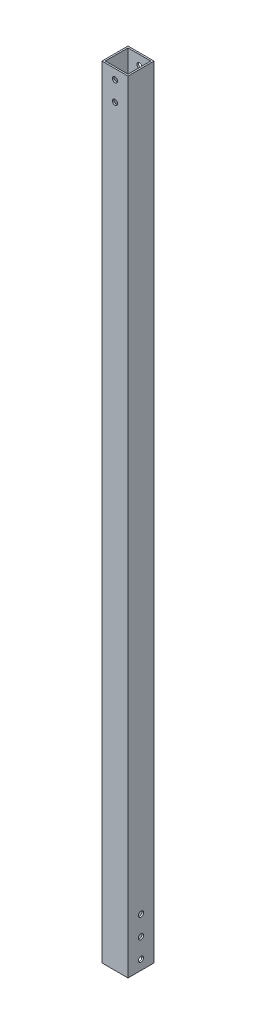
ISO-10303-21;
HEADER;
FILE_DESCRIPTION(('STEP AP214'),'2;1');
FILE_NAME('part.step','',(''),(''),'','','');
FILE_SCHEMA(('AUTOMOTIVE_DESIGN { 1 0 10303 214 1 1 1 1 }'));
ENDSEC;
DATA;
#1=APPLICATION_CONTEXT('core data for automotive mechanical design processes');
#2=APPLICATION_PROTOCOL_DEFINITION('international standard','automotive_design',2000,#1);
#3=PRODUCT_CONTEXT('',#1,'mechanical');
#4=PRODUCT('Part','Part','',(#3));
#5=PRODUCT_RELATED_PRODUCT_CATEGORY('part','',(#4));
#6=PRODUCT_DEFINITION_FORMATION('','',#4);
#7=PRODUCT_DEFINITION_CONTEXT('part definition',#1,'design');
#8=PRODUCT_DEFINITION('design','',#6,#7);
#9=PRODUCT_DEFINITION_SHAPE('','',#8);
#10=(LENGTH_UNIT() NAMED_UNIT(*) SI_UNIT(.MILLI.,.METRE.));
#11=(NAMED_UNIT(*) PLANE_ANGLE_UNIT() SI_UNIT($,.RADIAN.));
#12=(NAMED_UNIT(*) SI_UNIT($,.STERADIAN.) SOLID_ANGLE_UNIT());
#13=UNCERTAINTY_MEASURE_WITH_UNIT(LENGTH_MEASURE(1.E-05),#10,'distance_accuracy_value','');
#14=(GEOMETRIC_REPRESENTATION_CONTEXT(3) GLOBAL_UNCERTAINTY_ASSIGNED_CONTEXT((#13)) GLOBAL_UNIT_ASSIGNED_CONTEXT((#10,
#11,#12)) REPRESENTATION_CONTEXT('',''));
#15=CARTESIAN_POINT('',(0.,0.,0.));
#16=DIRECTION('',(0.,0.,1.));
#17=DIRECTION('',(1.,0.,0.));
#18=AXIS2_PLACEMENT_3D('',#15,#16,#17);
#19=CARTESIAN_POINT('',(0.,752.475,-12.7));
#20=DIRECTION('',(0.,0.,1.));
#21=DIRECTION('',(1.,0.,0.));
#22=AXIS2_PLACEMENT_3D('',#19,#20,#21);
#23=CYLINDRICAL_SURFACE('',#22,2.5527);
#24=CARTESIAN_POINT('',(0.,752.475,-11.1125));
#25=DIRECTION('',(0.,0.,1.));
#26=DIRECTION('',(1.,0.,0.));
#27=AXIS2_PLACEMENT_3D('',#24,#25,#26);
#28=CIRCLE('',#27,2.5527);
#29=CARTESIAN_POINT('',(2.5527,752.475,-11.1125));
#30=VERTEX_POINT('',#29);
#31=EDGE_CURVE('E263',#30,#30,#28,.T.);
#32=ORIENTED_EDGE('',*,*,#31,.T.);
#33=EDGE_LOOP('',(#32));
#34=FACE_BOUND('',#33,.T.);
#35=CARTESIAN_POINT('',(0.,752.475,-12.7));
#36=DIRECTION('',(0.,0.,1.));
#37=DIRECTION('',(1.,0.,0.));
#38=AXIS2_PLACEMENT_3D('',#35,#36,#37);
#39=CIRCLE('',#38,2.5527);
#40=CARTESIAN_POINT('',(2.5527,752.475,-12.7));
#41=VERTEX_POINT('',#40);
#42=EDGE_CURVE('E257',#41,#41,#39,.T.);
#43=ORIENTED_EDGE('',*,*,#42,.F.);
#44=EDGE_LOOP('',(#43));
#45=FACE_BOUND('',#44,.T.);
#46=ADVANCED_FACE('F17',(#34,#45),#23,.F.);
#47=CARTESIAN_POINT('',(0.,733.425,-12.7));
#48=DIRECTION('',(0.,0.,1.));
#49=DIRECTION('',(1.,0.,0.));
#50=AXIS2_PLACEMENT_3D('',#47,#48,#49);
#51=CYLINDRICAL_SURFACE('',#50,2.55270000000004);
#52=CARTESIAN_POINT('',(0.,733.425,-11.1125));
#53=DIRECTION('',(0.,0.,1.));
#54=DIRECTION('',(1.,0.,0.));
#55=AXIS2_PLACEMENT_3D('',#52,#53,#54);
#56=CIRCLE('',#55,2.55270000000004);
#57=CARTESIAN_POINT('',(2.55270000000004,733.425,-11.1125));
#58=VERTEX_POINT('',#57);
#59=EDGE_CURVE('E274',#58,#58,#56,.T.);
#60=ORIENTED_EDGE('',*,*,#59,.T.);
#61=EDGE_LOOP('',(#60));
#62=FACE_BOUND('',#61,.T.);
#63=CARTESIAN_POINT('',(0.,733.425,-12.7));
#64=DIRECTION('',(0.,0.,1.));
#65=DIRECTION('',(1.,0.,0.));
#66=AXIS2_PLACEMENT_3D('',#63,#64,#65);
#67=CIRCLE('',#66,2.55270000000004);
#68=CARTESIAN_POINT('',(2.55270000000004,733.425,-12.7));
#69=VERTEX_POINT('',#68);
#70=EDGE_CURVE('E196',#69,#69,#67,.T.);
#71=ORIENTED_EDGE('',*,*,#70,.F.);
#72=EDGE_LOOP('',(#71));
#73=FACE_BOUND('',#72,.T.);
#74=ADVANCED_FACE('F508',(#62,#73),#51,.F.);
#75=CARTESIAN_POINT('',(0.,752.475,-12.7));
#76=DIRECTION('',(0.,0.,1.));
#77=DIRECTION('',(1.,0.,0.));
#78=AXIS2_PLACEMENT_3D('',#75,#76,#77);
#79=CYLINDRICAL_SURFACE('',#78,2.5527);
#80=CARTESIAN_POINT('',(0.,752.475,11.1125));
#81=DIRECTION('',(0.,0.,-1.));
#82=DIRECTION('',(-1.,0.,0.));
#83=AXIS2_PLACEMENT_3D('',#80,#81,#82);
#84=CIRCLE('',#83,2.5527);
#85=CARTESIAN_POINT('',(-2.55270000000004,752.475,11.1125));
#86=VERTEX_POINT('',#85);
#87=EDGE_CURVE('E296',#86,#86,#84,.T.);
#88=ORIENTED_EDGE('',*,*,#87,.T.);
#89=EDGE_LOOP('',(#88));
#90=FACE_BOUND('',#89,.T.);
#91=CARTESIAN_POINT('',(0.,752.475,12.7));
#92=DIRECTION('',(0.,0.,1.));
#93=DIRECTION('',(1.,0.,0.));
#94=AXIS2_PLACEMENT_3D('',#91,#92,#93);
#95=CIRCLE('',#94,2.5527);
#96=CARTESIAN_POINT('',(2.5527,752.475,12.7));
#97=VERTEX_POINT('',#96);
#98=EDGE_CURVE('E249',#97,#97,#95,.T.);
#99=ORIENTED_EDGE('',*,*,#98,.T.);
#100=EDGE_LOOP('',(#99));
#101=FACE_BOUND('',#100,.T.);
#102=ADVANCED_FACE('F497',(#90,#101),#79,.F.);
#103=CARTESIAN_POINT('',(0.,733.425,-12.7));
#104=DIRECTION('',(0.,0.,1.));
#105=DIRECTION('',(1.,0.,0.));
#106=AXIS2_PLACEMENT_3D('',#103,#104,#105);
#107=CYLINDRICAL_SURFACE('',#106,2.55270000000004);
#108=CARTESIAN_POINT('',(0.,733.425,11.1125));
#109=DIRECTION('',(0.,0.,-1.));
#110=DIRECTION('',(-1.,0.,0.));
#111=AXIS2_PLACEMENT_3D('',#108,#109,#110);
#112=CIRCLE('',#111,2.55270000000004);
#113=CARTESIAN_POINT('',(-2.55270000000004,733.425,11.1125));
#114=VERTEX_POINT('',#113);
#115=EDGE_CURVE('E299',#114,#114,#112,.T.);
#116=ORIENTED_EDGE('',*,*,#115,.T.);
#117=EDGE_LOOP('',(#116));
#118=FACE_BOUND('',#117,.T.);
#119=CARTESIAN_POINT('',(0.,733.425,12.7));
#120=DIRECTION('',(0.,0.,1.));
#121=DIRECTION('',(1.,0.,0.));
#122=AXIS2_PLACEMENT_3D('',#119,#120,#121);
#123=CIRCLE('',#122,2.55270000000004);
#124=CARTESIAN_POINT('',(2.55270000000004,733.425,12.7));
#125=VERTEX_POINT('',#124);
#126=EDGE_CURVE('E245',#125,#125,#123,.T.);
#127=ORIENTED_EDGE('',*,*,#126,.T.);
#128=EDGE_LOOP('',(#127));
#129=FACE_BOUND('',#128,.T.);
#130=ADVANCED_FACE('F487',(#118,#129),#107,.F.);
#131=CARTESIAN_POINT('',(12.7,47.625,0.));
#132=DIRECTION('',(-1.,0.,0.));
#133=DIRECTION('',(0.,0.,1.));
#134=AXIS2_PLACEMENT_3D('',#131,#132,#133);
#135=CYLINDRICAL_SURFACE('',#134,2.5527);
#136=CARTESIAN_POINT('',(-11.1125,47.625,0.));
#137=DIRECTION('',(1.,0.,0.));
#138=DIRECTION('',(0.,0.,-1.));
#139=AXIS2_PLACEMENT_3D('',#136,#137,#138);
#140=CIRCLE('',#139,2.5527);
#141=CARTESIAN_POINT('',(-11.1125,47.625,-2.5527));
#142=VERTEX_POINT('',#141);
#143=EDGE_CURVE('E284',#142,#142,#140,.T.);
#144=ORIENTED_EDGE('',*,*,#143,.T.);
#145=EDGE_LOOP('',(#144));
#146=FACE_BOUND('',#145,.T.);
#147=CARTESIAN_POINT('',(-12.7,47.625,0.));
#148=DIRECTION('',(-1.,0.,0.));
#149=DIRECTION('',(0.,0.,1.));
#150=AXIS2_PLACEMENT_3D('',#147,#148,#149);
#151=CIRCLE('',#150,2.5527);
#152=CARTESIAN_POINT('',(-12.7,47.625,2.5527));
#153=VERTEX_POINT('',#152);
#154=EDGE_CURVE('E195',#153,#153,#151,.T.);
#155=ORIENTED_EDGE('',*,*,#154,.T.);
#156=EDGE_LOOP('',(#155));
#157=FACE_BOUND('',#156,.T.);
#158=ADVANCED_FACE('F477',(#146,#157),#135,.F.);
#159=CARTESIAN_POINT('',(12.7,47.625,0.));
#160=DIRECTION('',(-1.,0.,0.));
#161=DIRECTION('',(0.,0.,1.));
#162=AXIS2_PLACEMENT_3D('',#159,#160,#161);
#163=CYLINDRICAL_SURFACE('',#162,2.5527);
#164=CARTESIAN_POINT('',(11.1125,47.625,0.));
#165=DIRECTION('',(-1.,0.,0.));
#166=DIRECTION('',(0.,0.,1.));
#167=AXIS2_PLACEMENT_3D('',#164,#165,#166);
#168=CIRCLE('',#167,2.5527);
#169=CARTESIAN_POINT('',(11.1125,47.625,2.5527));
#170=VERTEX_POINT('',#169);
#171=EDGE_CURVE('E301',#170,#170,#168,.T.);
#172=ORIENTED_EDGE('',*,*,#171,.T.);
#173=EDGE_LOOP('',(#172));
#174=FACE_BOUND('',#173,.T.);
#175=CARTESIAN_POINT('',(12.7,47.625,0.));
#176=DIRECTION('',(-1.,0.,0.));
#177=DIRECTION('',(0.,0.,1.));
#178=AXIS2_PLACEMENT_3D('',#175,#176,#177);
#179=CIRCLE('',#178,2.5527);
#180=CARTESIAN_POINT('',(12.7,47.625,2.5527));
#181=VERTEX_POINT('',#180);
#182=EDGE_CURVE('E241',#181,#181,#179,.T.);
#183=ORIENTED_EDGE('',*,*,#182,.F.);
#184=EDGE_LOOP('',(#183));
#185=FACE_BOUND('',#184,.T.);
#186=ADVANCED_FACE('F467',(#174,#185),#163,.F.);
#187=CARTESIAN_POINT('',(12.7,28.575,0.));
#188=DIRECTION('',(-1.,0.,0.));
#189=DIRECTION('',(0.,0.,1.));
#190=AXIS2_PLACEMENT_3D('',#187,#188,#189);
#191=CYLINDRICAL_SURFACE('',#190,2.5527);
#192=CARTESIAN_POINT('',(-11.1125,28.575,0.));
#193=DIRECTION('',(1.,0.,0.));
#194=DIRECTION('',(0.,0.,-1.));
#195=AXIS2_PLACEMENT_3D('',#192,#193,#194);
#196=CIRCLE('',#195,2.5527);
#197=CARTESIAN_POINT('',(-11.1125,28.575,-2.5527));
#198=VERTEX_POINT('',#197);
#199=EDGE_CURVE('E287',#198,#198,#196,.T.);
#200=ORIENTED_EDGE('',*,*,#199,.T.);
#201=EDGE_LOOP('',(#200));
#202=FACE_BOUND('',#201,.T.);
#203=CARTESIAN_POINT('',(-12.7,28.575,0.));
#204=DIRECTION('',(-1.,0.,0.));
#205=DIRECTION('',(0.,0.,1.));
#206=AXIS2_PLACEMENT_3D('',#203,#204,#205);
#207=CIRCLE('',#206,2.5527);
#208=CARTESIAN_POINT('',(-12.7,28.575,2.5527));
#209=VERTEX_POINT('',#208);
#210=EDGE_CURVE('E266',#209,#209,#207,.T.);
#211=ORIENTED_EDGE('',*,*,#210,.T.);
#212=EDGE_LOOP('',(#211));
#213=FACE_BOUND('',#212,.T.);
#214=ADVANCED_FACE('F457',(#202,#213),#191,.F.);
#215=CARTESIAN_POINT('',(12.7,9.525,0.));
#216=DIRECTION('',(-1.,0.,0.));
#217=DIRECTION('',(0.,0.,1.));
#218=AXIS2_PLACEMENT_3D('',#215,#216,#217);
#219=CYLINDRICAL_SURFACE('',#218,2.5527);
#220=CARTESIAN_POINT('',(-11.1125,9.525,0.));
#221=DIRECTION('',(1.,0.,0.));
#222=DIRECTION('',(0.,0.,-1.));
#223=AXIS2_PLACEMENT_3D('',#220,#221,#222);
#224=CIRCLE('',#223,2.5527);
#225=CARTESIAN_POINT('',(-11.1125,9.525,-2.5527));
#226=VERTEX_POINT('',#225);
#227=EDGE_CURVE('E290',#226,#226,#224,.T.);
#228=ORIENTED_EDGE('',*,*,#227,.T.);
#229=EDGE_LOOP('',(#228));
#230=FACE_BOUND('',#229,.T.);
#231=CARTESIAN_POINT('',(-12.7,9.525,0.));
#232=DIRECTION('',(-1.,0.,0.));
#233=DIRECTION('',(0.,0.,1.));
#234=AXIS2_PLACEMENT_3D('',#231,#232,#233);
#235=CIRCLE('',#234,2.5527);
#236=CARTESIAN_POINT('',(-12.7,9.525,2.5527));
#237=VERTEX_POINT('',#236);
#238=EDGE_CURVE('E269',#237,#237,#235,.T.);
#239=ORIENTED_EDGE('',*,*,#238,.T.);
#240=EDGE_LOOP('',(#239));
#241=FACE_BOUND('',#240,.T.);
#242=ADVANCED_FACE('F447',(#230,#241),#219,.F.);
#243=CARTESIAN_POINT('',(12.7,28.575,0.));
#244=DIRECTION('',(-1.,0.,0.));
#245=DIRECTION('',(0.,0.,1.));
#246=AXIS2_PLACEMENT_3D('',#243,#244,#245);
#247=CYLINDRICAL_SURFACE('',#246,2.5527);
#248=CARTESIAN_POINT('',(11.1125,28.575,0.));
#249=DIRECTION('',(-1.,0.,0.));
#250=DIRECTION('',(0.,0.,1.));
#251=AXIS2_PLACEMENT_3D('',#248,#249,#250);
#252=CIRCLE('',#251,2.5527);
#253=CARTESIAN_POINT('',(11.1125,28.575,2.5527));
#254=VERTEX_POINT('',#253);
#255=EDGE_CURVE('E20',#254,#254,#252,.T.);
#256=ORIENTED_EDGE('',*,*,#255,.T.);
#257=EDGE_LOOP('',(#256));
#258=FACE_BOUND('',#257,.T.);
#259=CARTESIAN_POINT('',(12.7,28.575,0.));
#260=DIRECTION('',(-1.,0.,0.));
#261=DIRECTION('',(0.,0.,1.));
#262=AXIS2_PLACEMENT_3D('',#259,#260,#261);
#263=CIRCLE('',#262,2.5527);
#264=CARTESIAN_POINT('',(12.7,28.575,2.5527));
#265=VERTEX_POINT('',#264);
#266=EDGE_CURVE('E244',#265,#265,#263,.T.);
#267=ORIENTED_EDGE('',*,*,#266,.F.);
#268=EDGE_LOOP('',(#267));
#269=FACE_BOUND('',#268,.T.);
#270=ADVANCED_FACE('F437',(#258,#269),#247,.F.);
#271=CARTESIAN_POINT('',(12.7,9.525,0.));
#272=DIRECTION('',(-1.,0.,0.));
#273=DIRECTION('',(0.,0.,1.));
#274=AXIS2_PLACEMENT_3D('',#271,#272,#273);
#275=CYLINDRICAL_SURFACE('',#274,2.5527);
#276=CARTESIAN_POINT('',(11.1125,9.525,0.));
#277=DIRECTION('',(-1.,0.,0.));
#278=DIRECTION('',(0.,0.,1.));
#279=AXIS2_PLACEMENT_3D('',#276,#277,#278);
#280=CIRCLE('',#279,2.5527);
#281=CARTESIAN_POINT('',(11.1125,9.525,2.5527));
#282=VERTEX_POINT('',#281);
#283=EDGE_CURVE('E11',#282,#282,#280,.T.);
#284=ORIENTED_EDGE('',*,*,#283,.T.);
#285=EDGE_LOOP('',(#284));
#286=FACE_BOUND('',#285,.T.);
#287=CARTESIAN_POINT('',(12.7,9.525,0.));
#288=DIRECTION('',(-1.,0.,0.));
#289=DIRECTION('',(0.,0.,1.));
#290=AXIS2_PLACEMENT_3D('',#287,#288,#289);
#291=CIRCLE('',#290,2.5527);
#292=CARTESIAN_POINT('',(12.7,9.525,2.5527));
#293=VERTEX_POINT('',#292);
#294=EDGE_CURVE('E252',#293,#293,#291,.T.);
#295=ORIENTED_EDGE('',*,*,#294,.F.);
#296=EDGE_LOOP('',(#295));
#297=FACE_BOUND('',#296,.T.);
#298=ADVANCED_FACE('F427',(#286,#297),#275,.F.);
#299=CARTESIAN_POINT('',(11.1125,762.,-11.1125));
#300=DIRECTION('',(-1.,0.,0.));
#301=DIRECTION('',(0.,1.,0.));
#302=AXIS2_PLACEMENT_3D('',#299,#300,#301);
#303=PLANE('',#302);
#304=ORIENTED_EDGE('',*,*,#283,.F.);
#305=EDGE_LOOP('',(#304));
#306=FACE_BOUND('',#305,.T.);
#307=ORIENTED_EDGE('',*,*,#255,.F.);
#308=EDGE_LOOP('',(#307));
#309=FACE_BOUND('',#308,.T.);
#310=ORIENTED_EDGE('',*,*,#171,.F.);
#311=EDGE_LOOP('',(#310));
#312=FACE_BOUND('',#311,.T.);
#313=DIRECTION('',(0.,0.,-1.));
#314=VECTOR('',#313,1.);
#315=CARTESIAN_POINT('',(11.1125,0.,-11.1125));
#316=LINE('',#315,#314);
#317=CARTESIAN_POINT('',(11.1125,0.,11.1125));
#318=VERTEX_POINT('',#317);
#319=CARTESIAN_POINT('',(11.1125,0.,-11.1125));
#320=VERTEX_POINT('',#319);
#321=EDGE_CURVE('E230',#318,#320,#316,.T.);
#322=ORIENTED_EDGE('',*,*,#321,.F.);
#323=DIRECTION('',(0.,-1.,0.));
#324=VECTOR('',#323,1.);
#325=CARTESIAN_POINT('',(11.1125,762.,11.1125));
#326=LINE('',#325,#324);
#327=CARTESIAN_POINT('',(11.1125,762.,11.1125));
#328=VERTEX_POINT('',#327);
#329=EDGE_CURVE('E293',#328,#318,#326,.T.);
#330=ORIENTED_EDGE('',*,*,#329,.F.);
#331=DIRECTION('',(0.,0.,-1.));
#332=VECTOR('',#331,1.);
#333=CARTESIAN_POINT('',(11.1125,762.,-11.1125));
#334=LINE('',#333,#332);
#335=CARTESIAN_POINT('',(11.1125,762.,-11.1125));
#336=VERTEX_POINT('',#335);
#337=EDGE_CURVE('E882',#328,#336,#334,.T.);
#338=ORIENTED_EDGE('',*,*,#337,.T.);
#339=DIRECTION('',(0.,-1.,0.));
#340=VECTOR('',#339,1.);
#341=CARTESIAN_POINT('',(11.1125,762.,-11.1125));
#342=LINE('',#341,#340);
#343=EDGE_CURVE('E248',#336,#320,#342,.T.);
#344=ORIENTED_EDGE('',*,*,#343,.T.);
#345=EDGE_LOOP('',(#322,#330,#338,#344));
#346=FACE_BOUND('',#345,.T.);
#347=ADVANCED_FACE('F417',(#306,#309,#312,#346),#303,.T.);
#348=CARTESIAN_POINT('',(-11.1125,762.,11.1125));
#349=DIRECTION('',(0.,0.,-1.));
#350=DIRECTION('',(0.,-1.,0.));
#351=AXIS2_PLACEMENT_3D('',#348,#349,#350);
#352=PLANE('',#351);
#353=ORIENTED_EDGE('',*,*,#115,.F.);
#354=EDGE_LOOP('',(#353));
#355=FACE_BOUND('',#354,.T.);
#356=ORIENTED_EDGE('',*,*,#87,.F.);
#357=EDGE_LOOP('',(#356));
#358=FACE_BOUND('',#357,.T.);
#359=DIRECTION('',(1.,0.,0.));
#360=VECTOR('',#359,1.);
#361=CARTESIAN_POINT('',(-11.1125,0.,11.1125));
#362=LINE('',#361,#360);
#363=CARTESIAN_POINT('',(-11.1125,0.,11.1125));
#364=VERTEX_POINT('',#363);
#365=EDGE_CURVE('E226',#364,#318,#362,.T.);
#366=ORIENTED_EDGE('',*,*,#365,.F.);
#367=DIRECTION('',(0.,-1.,0.));
#368=VECTOR('',#367,1.);
#369=CARTESIAN_POINT('',(-11.1125,762.,11.1125));
#370=LINE('',#369,#368);
#371=CARTESIAN_POINT('',(-11.1125,762.,11.1125));
#372=VERTEX_POINT('',#371);
#373=EDGE_CURVE('E277',#372,#364,#370,.T.);
#374=ORIENTED_EDGE('',*,*,#373,.F.);
#375=DIRECTION('',(1.,0.,0.));
#376=VECTOR('',#375,1.);
#377=CARTESIAN_POINT('',(-11.1125,762.,11.1125));
#378=LINE('',#377,#376);
#379=EDGE_CURVE('E217',#372,#328,#378,.T.);
#380=ORIENTED_EDGE('',*,*,#379,.T.);
#381=ORIENTED_EDGE('',*,*,#329,.T.);
#382=EDGE_LOOP('',(#366,#374,#380,#381));
#383=FACE_BOUND('',#382,.T.);
#384=ADVANCED_FACE('F406',(#355,#358,#383),#352,.T.);
#385=CARTESIAN_POINT('',(-11.1125,762.,-11.1125));
#386=DIRECTION('',(1.,0.,0.));
#387=DIRECTION('',(0.,0.,-1.));
#388=AXIS2_PLACEMENT_3D('',#385,#386,#387);
#389=PLANE('',#388);
#390=ORIENTED_EDGE('',*,*,#227,.F.);
#391=EDGE_LOOP('',(#390));
#392=FACE_BOUND('',#391,.T.);
#393=ORIENTED_EDGE('',*,*,#199,.F.);
#394=EDGE_LOOP('',(#393));
#395=FACE_BOUND('',#394,.T.);
#396=ORIENTED_EDGE('',*,*,#143,.F.);
#397=EDGE_LOOP('',(#396));
#398=FACE_BOUND('',#397,.T.);
#399=DIRECTION('',(0.,0.,1.));
#400=VECTOR('',#399,1.);
#401=CARTESIAN_POINT('',(-11.1125,0.,-11.1125));
#402=LINE('',#401,#400);
#403=CARTESIAN_POINT('',(-11.1125,0.,-11.1125));
#404=VERTEX_POINT('',#403);
#405=EDGE_CURVE('E222',#404,#364,#402,.T.);
#406=ORIENTED_EDGE('',*,*,#405,.F.);
#407=DIRECTION('',(0.,-1.,0.));
#408=VECTOR('',#407,1.);
#409=CARTESIAN_POINT('',(-11.1125,762.,-11.1125));
#410=LINE('',#409,#408);
#411=CARTESIAN_POINT('',(-11.1125,762.,-11.1125));
#412=VERTEX_POINT('',#411);
#413=EDGE_CURVE('E260',#412,#404,#410,.T.);
#414=ORIENTED_EDGE('',*,*,#413,.F.);
#415=DIRECTION('',(0.,0.,1.));
#416=VECTOR('',#415,1.);
#417=CARTESIAN_POINT('',(-11.1125,762.,-11.1125));
#418=LINE('',#417,#416);
#419=EDGE_CURVE('E883',#412,#372,#418,.T.);
#420=ORIENTED_EDGE('',*,*,#419,.T.);
#421=ORIENTED_EDGE('',*,*,#373,.T.);
#422=EDGE_LOOP('',(#406,#414,#420,#421));
#423=FACE_BOUND('',#422,.T.);
#424=ADVANCED_FACE('F395',(#392,#395,#398,#423),#389,.T.);
#425=CARTESIAN_POINT('',(-11.1125,762.,-11.1125));
#426=DIRECTION('',(0.,0.,1.));
#427=DIRECTION('',(1.,0.,0.));
#428=AXIS2_PLACEMENT_3D('',#425,#426,#427);
#429=PLANE('',#428);
#430=ORIENTED_EDGE('',*,*,#59,.F.);
#431=EDGE_LOOP('',(#430));
#432=FACE_BOUND('',#431,.T.);
#433=ORIENTED_EDGE('',*,*,#31,.F.);
#434=EDGE_LOOP('',(#433));
#435=FACE_BOUND('',#434,.T.);
#436=DIRECTION('',(-1.,0.,0.));
#437=VECTOR('',#436,1.);
#438=CARTESIAN_POINT('',(-11.1125,0.,-11.1125));
#439=LINE('',#438,#437);
#440=EDGE_CURVE('E227',#320,#404,#439,.T.);
#441=ORIENTED_EDGE('',*,*,#440,.F.);
#442=ORIENTED_EDGE('',*,*,#343,.F.);
#443=DIRECTION('',(-1.,0.,0.));
#444=VECTOR('',#443,1.);
#445=CARTESIAN_POINT('',(-11.1125,762.,-11.1125));
#446=LINE('',#445,#444);
#447=EDGE_CURVE('E877',#336,#412,#446,.T.);
#448=ORIENTED_EDGE('',*,*,#447,.T.);
#449=ORIENTED_EDGE('',*,*,#413,.T.);
#450=EDGE_LOOP('',(#441,#442,#448,#449));
#451=FACE_BOUND('',#450,.T.);
#452=ADVANCED_FACE('F384',(#432,#435,#451),#429,.T.);
#453=CARTESIAN_POINT('',(-12.7,762.,12.7));
#454=DIRECTION('',(0.,0.,-1.));
#455=DIRECTION('',(0.,-1.,0.));
#456=AXIS2_PLACEMENT_3D('',#453,#454,#455);
#457=PLANE('',#456);
#458=ORIENTED_EDGE('',*,*,#126,.F.);
#459=EDGE_LOOP('',(#458));
#460=FACE_BOUND('',#459,.T.);
#461=ORIENTED_EDGE('',*,*,#98,.F.);
#462=EDGE_LOOP('',(#461));
#463=FACE_BOUND('',#462,.T.);
#464=DIRECTION('',(1.,0.,0.));
#465=VECTOR('',#464,1.);
#466=CARTESIAN_POINT('',(-12.7,0.,12.7));
#467=LINE('',#466,#465);
#468=CARTESIAN_POINT('',(-12.7,0.,12.7));
#469=VERTEX_POINT('',#468);
#470=CARTESIAN_POINT('',(12.7,0.,12.7));
#471=VERTEX_POINT('',#470);
#472=EDGE_CURVE('E187',#469,#471,#467,.T.);
#473=ORIENTED_EDGE('',*,*,#472,.T.);
#474=DIRECTION('',(0.,-1.,0.));
#475=VECTOR('',#474,1.);
#476=CARTESIAN_POINT('',(12.7,762.,12.7));
#477=LINE('',#476,#475);
#478=CARTESIAN_POINT('',(12.7,762.,12.7));
#479=VERTEX_POINT('',#478);
#480=EDGE_CURVE('E238',#479,#471,#477,.T.);
#481=ORIENTED_EDGE('',*,*,#480,.F.);
#482=DIRECTION('',(1.,0.,0.));
#483=VECTOR('',#482,1.);
#484=CARTESIAN_POINT('',(-12.7,762.,12.7));
#485=LINE('',#484,#483);
#486=CARTESIAN_POINT('',(-12.7,762.,12.7));
#487=VERTEX_POINT('',#486);
#488=EDGE_CURVE('E190',#487,#479,#485,.T.);
#489=ORIENTED_EDGE('',*,*,#488,.F.);
#490=DIRECTION('',(0.,-1.,0.));
#491=VECTOR('',#490,1.);
#492=CARTESIAN_POINT('',(-12.7,762.,12.7));
#493=LINE('',#492,#491);
#494=EDGE_CURVE('E183',#487,#469,#493,.T.);
#495=ORIENTED_EDGE('',*,*,#494,.T.);
#496=EDGE_LOOP('',(#473,#481,#489,#495));
#497=FACE_BOUND('',#496,.T.);
#498=ADVANCED_FACE('F185',(#460,#463,#497),#457,.F.);
#499=CARTESIAN_POINT('',(-12.7,762.,-12.7));
#500=DIRECTION('',(1.,0.,0.));
#501=DIRECTION('',(0.,0.,-1.));
#502=AXIS2_PLACEMENT_3D('',#499,#500,#501);
#503=PLANE('',#502);
#504=ORIENTED_EDGE('',*,*,#238,.F.);
#505=EDGE_LOOP('',(#504));
#506=FACE_BOUND('',#505,.T.);
#507=ORIENTED_EDGE('',*,*,#210,.F.);
#508=EDGE_LOOP('',(#507));
#509=FACE_BOUND('',#508,.T.);
#510=ORIENTED_EDGE('',*,*,#154,.F.);
#511=EDGE_LOOP('',(#510));
#512=FACE_BOUND('',#511,.T.);
#513=DIRECTION('',(0.,0.,1.));
#514=VECTOR('',#513,1.);
#515=CARTESIAN_POINT('',(-12.7,0.,-12.7));
#516=LINE('',#515,#514);
#517=CARTESIAN_POINT('',(-12.7,0.,-12.7));
#518=VERTEX_POINT('',#517);
#519=EDGE_CURVE('E199',#518,#469,#516,.T.);
#520=ORIENTED_EDGE('',*,*,#519,.T.);
#521=ORIENTED_EDGE('',*,*,#494,.F.);
#522=DIRECTION('',(0.,0.,1.));
#523=VECTOR('',#522,1.);
#524=CARTESIAN_POINT('',(-12.7,762.,-12.7));
#525=LINE('',#524,#523);
#526=CARTESIAN_POINT('',(-12.7,762.,-12.7));
#527=VERTEX_POINT('',#526);
#528=EDGE_CURVE('E902',#527,#487,#525,.T.);
#529=ORIENTED_EDGE('',*,*,#528,.F.);
#530=DIRECTION('',(0.,-1.,0.));
#531=VECTOR('',#530,1.);
#532=CARTESIAN_POINT('',(-12.7,762.,-12.7));
#533=LINE('',#532,#531);
#534=EDGE_CURVE('E201',#527,#518,#533,.T.);
#535=ORIENTED_EDGE('',*,*,#534,.T.);
#536=EDGE_LOOP('',(#520,#521,#529,#535));
#537=FACE_BOUND('',#536,.T.);
#538=ADVANCED_FACE('F200',(#506,#509,#512,#537),#503,.F.);
#539=CARTESIAN_POINT('',(-12.7,762.,-12.7));
#540=DIRECTION('',(0.,0.,1.));
#541=DIRECTION('',(1.,0.,0.));
#542=AXIS2_PLACEMENT_3D('',#539,#540,#541);
#543=PLANE('',#542);
#544=ORIENTED_EDGE('',*,*,#70,.T.);
#545=EDGE_LOOP('',(#544));
#546=FACE_BOUND('',#545,.T.);
#547=ORIENTED_EDGE('',*,*,#42,.T.);
#548=EDGE_LOOP('',(#547));
#549=FACE_BOUND('',#548,.T.);
#550=DIRECTION('',(-1.,0.,0.));
#551=VECTOR('',#550,1.);
#552=CARTESIAN_POINT('',(-12.7,0.,-12.7));
#553=LINE('',#552,#551);
#554=CARTESIAN_POINT('',(12.7,0.,-12.7));
#555=VERTEX_POINT('',#554);
#556=EDGE_CURVE('E206',#555,#518,#553,.T.);
#557=ORIENTED_EDGE('',*,*,#556,.T.);
#558=ORIENTED_EDGE('',*,*,#534,.F.);
#559=DIRECTION('',(-1.,0.,0.));
#560=VECTOR('',#559,1.);
#561=CARTESIAN_POINT('',(-12.7,762.,-12.7));
#562=LINE('',#561,#560);
#563=CARTESIAN_POINT('',(12.7,762.,-12.7));
#564=VERTEX_POINT('',#563);
#565=EDGE_CURVE('E916',#564,#527,#562,.T.);
#566=ORIENTED_EDGE('',*,*,#565,.F.);
#567=DIRECTION('',(0.,-1.,0.));
#568=VECTOR('',#567,1.);
#569=CARTESIAN_POINT('',(12.7,762.,-12.7));
#570=LINE('',#569,#568);
#571=EDGE_CURVE('E235',#564,#555,#570,.T.);
#572=ORIENTED_EDGE('',*,*,#571,.T.);
#573=EDGE_LOOP('',(#557,#558,#566,#572));
#574=FACE_BOUND('',#573,.T.);
#575=ADVANCED_FACE('F350',(#546,#549,#574),#543,.F.);
#576=CARTESIAN_POINT('',(12.7,762.,-12.7));
#577=DIRECTION('',(-1.,0.,0.));
#578=DIRECTION('',(0.,0.,1.));
#579=AXIS2_PLACEMENT_3D('',#576,#577,#578);
#580=PLANE('',#579);
#581=ORIENTED_EDGE('',*,*,#294,.T.);
#582=EDGE_LOOP('',(#581));
#583=FACE_BOUND('',#582,.T.);
#584=ORIENTED_EDGE('',*,*,#266,.T.);
#585=EDGE_LOOP('',(#584));
#586=FACE_BOUND('',#585,.T.);
#587=ORIENTED_EDGE('',*,*,#182,.T.);
#588=EDGE_LOOP('',(#587));
#589=FACE_BOUND('',#588,.T.);
#590=DIRECTION('',(0.,0.,-1.));
#591=VECTOR('',#590,1.);
#592=CARTESIAN_POINT('',(12.7,0.,-12.7));
#593=LINE('',#592,#591);
#594=EDGE_CURVE('E210',#471,#555,#593,.T.);
#595=ORIENTED_EDGE('',*,*,#594,.T.);
#596=ORIENTED_EDGE('',*,*,#571,.F.);
#597=DIRECTION('',(0.,0.,-1.));
#598=VECTOR('',#597,1.);
#599=CARTESIAN_POINT('',(12.7,762.,-12.7));
#600=LINE('',#599,#598);
#601=EDGE_CURVE('E924',#479,#564,#600,.T.);
#602=ORIENTED_EDGE('',*,*,#601,.F.);
#603=ORIENTED_EDGE('',*,*,#480,.T.);
#604=EDGE_LOOP('',(#595,#596,#602,#603));
#605=FACE_BOUND('',#604,.T.);
#606=ADVANCED_FACE('F338',(#583,#586,#589,#605),#580,.F.);
#607=CARTESIAN_POINT('',(0.,0.,0.));
#608=DIRECTION('',(0.,1.,0.));
#609=DIRECTION('',(1.,0.,0.));
#610=AXIS2_PLACEMENT_3D('',#607,#608,#609);
#611=PLANE('',#610);
#612=ORIENTED_EDGE('',*,*,#440,.T.);
#613=ORIENTED_EDGE('',*,*,#405,.T.);
#614=ORIENTED_EDGE('',*,*,#365,.T.);
#615=ORIENTED_EDGE('',*,*,#321,.T.);
#616=EDGE_LOOP('',(#612,#613,#614,#615));
#617=FACE_BOUND('',#616,.T.);
#618=ORIENTED_EDGE('',*,*,#594,.F.);
#619=ORIENTED_EDGE('',*,*,#472,.F.);
#620=ORIENTED_EDGE('',*,*,#519,.F.);
#621=ORIENTED_EDGE('',*,*,#556,.F.);
#622=EDGE_LOOP('',(#618,#619,#620,#621));
#623=FACE_BOUND('',#622,.T.);
#624=ADVANCED_FACE('F208',(#617,#623),#611,.F.);
#625=CARTESIAN_POINT('',(0.,762.,0.));
#626=DIRECTION('',(0.,1.,0.));
#627=DIRECTION('',(1.,0.,0.));
#628=AXIS2_PLACEMENT_3D('',#625,#626,#627);
#629=PLANE('',#628);
#630=ORIENTED_EDGE('',*,*,#419,.F.);
#631=ORIENTED_EDGE('',*,*,#447,.F.);
#632=ORIENTED_EDGE('',*,*,#337,.F.);
#633=ORIENTED_EDGE('',*,*,#379,.F.);
#634=EDGE_LOOP('',(#630,#631,#632,#633));
#635=FACE_BOUND('',#634,.T.);
#636=ORIENTED_EDGE('',*,*,#601,.T.);
#637=ORIENTED_EDGE('',*,*,#565,.T.);
#638=ORIENTED_EDGE('',*,*,#528,.T.);
#639=ORIENTED_EDGE('',*,*,#488,.T.);
#640=EDGE_LOOP('',(#636,#637,#638,#639));
#641=FACE_BOUND('',#640,.T.);
#642=ADVANCED_FACE('F321',(#635,#641),#629,.T.);
#643=CLOSED_SHELL('',(#46,#74,#102,#130,#158,#186,#214,#242,#270,#298,#347,#384,#424,#452,#498,
#538,#575,#606,#624,#642));
#644=MANIFOLD_SOLID_BREP('B1',#643);
#645=ADVANCED_BREP_SHAPE_REPRESENTATION('',(#18,#644),#14);
#646=SHAPE_DEFINITION_REPRESENTATION(#9,#645);
ENDSEC;
END-ISO-10303-21;
